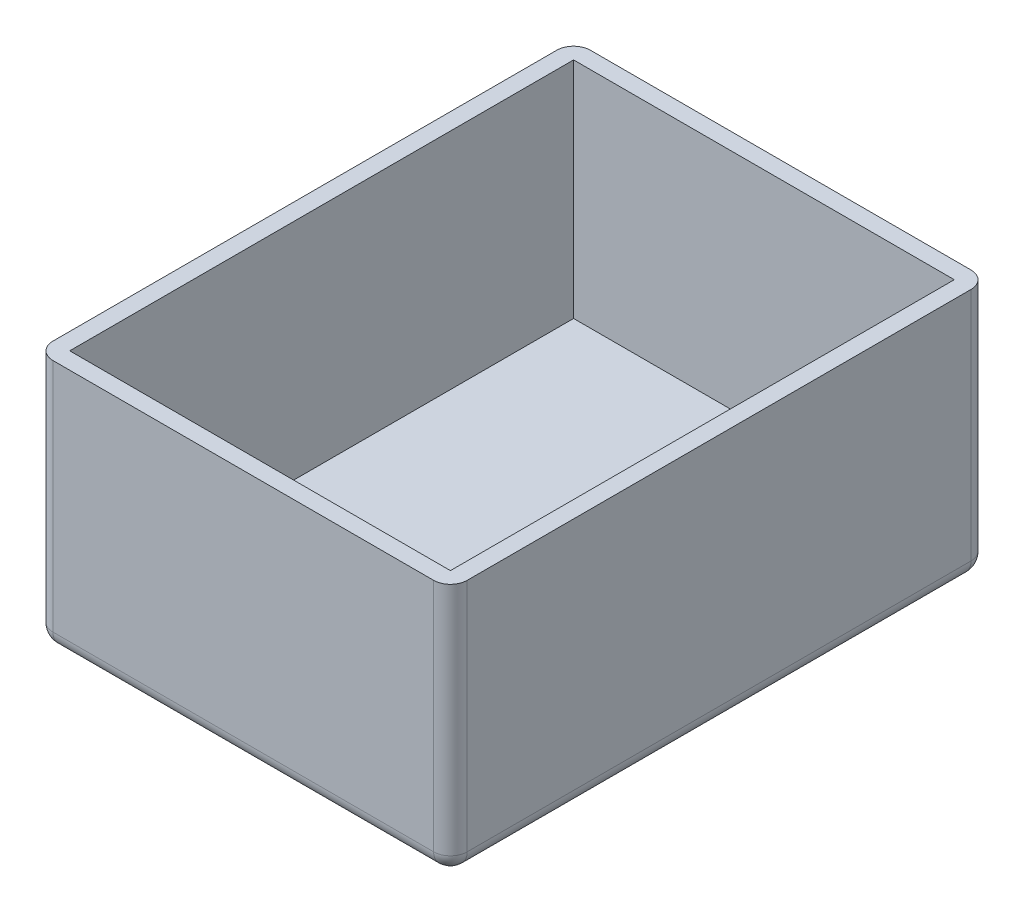
ISO-10303-21;
HEADER;
FILE_DESCRIPTION(('STEP AP214'),'2;1');
FILE_NAME('part.step','',(''),(''),'','','');
FILE_SCHEMA(('AUTOMOTIVE_DESIGN { 1 0 10303 214 1 1 1 1 }'));
ENDSEC;
DATA;
#1=APPLICATION_CONTEXT('core data for automotive mechanical design processes');
#2=APPLICATION_PROTOCOL_DEFINITION('international standard','automotive_design',2000,#1);
#3=PRODUCT_CONTEXT('',#1,'mechanical');
#4=PRODUCT('Part','Part','',(#3));
#5=PRODUCT_RELATED_PRODUCT_CATEGORY('part','',(#4));
#6=PRODUCT_DEFINITION_FORMATION('','',#4);
#7=PRODUCT_DEFINITION_CONTEXT('part definition',#1,'design');
#8=PRODUCT_DEFINITION('design','',#6,#7);
#9=PRODUCT_DEFINITION_SHAPE('','',#8);
#10=(LENGTH_UNIT() NAMED_UNIT(*) SI_UNIT(.MILLI.,.METRE.));
#11=(NAMED_UNIT(*) PLANE_ANGLE_UNIT() SI_UNIT($,.RADIAN.));
#12=(NAMED_UNIT(*) SI_UNIT($,.STERADIAN.) SOLID_ANGLE_UNIT());
#13=UNCERTAINTY_MEASURE_WITH_UNIT(LENGTH_MEASURE(1.E-05),#10,'distance_accuracy_value','');
#14=(GEOMETRIC_REPRESENTATION_CONTEXT(3) GLOBAL_UNCERTAINTY_ASSIGNED_CONTEXT((#13)) GLOBAL_UNIT_ASSIGNED_CONTEXT((#10,
#11,#12)) REPRESENTATION_CONTEXT('',''));
#15=CARTESIAN_POINT('',(0.,0.,0.));
#16=DIRECTION('',(0.,0.,1.));
#17=DIRECTION('',(1.,0.,0.));
#18=AXIS2_PLACEMENT_3D('',#15,#16,#17);
#19=CARTESIAN_POINT('',(0.,45.,0.));
#20=DIRECTION('',(1.,0.,0.));
#21=DIRECTION('',(0.,0.,-1.));
#22=AXIS2_PLACEMENT_3D('',#19,#20,#21);
#23=PLANE('',#22);
#24=DIRECTION('',(0.,0.,1.));
#25=VECTOR('',#24,1.);
#26=CARTESIAN_POINT('',(0.,45.,0.));
#27=LINE('',#26,#25);
#28=CARTESIAN_POINT('',(0.,45.,3.));
#29=VERTEX_POINT('',#28);
#30=CARTESIAN_POINT('',(0.,45.,93.));
#31=VERTEX_POINT('',#30);
#32=EDGE_CURVE('E193',#29,#31,#27,.T.);
#33=ORIENTED_EDGE('',*,*,#32,.F.);
#34=DIRECTION('',(0.,-1.,0.));
#35=VECTOR('',#34,1.);
#36=CARTESIAN_POINT('',(0.,45.,3.));
#37=LINE('',#36,#35);
#38=CARTESIAN_POINT('',(0.,3.,3.));
#39=VERTEX_POINT('',#38);
#40=EDGE_CURVE('E228',#29,#39,#37,.T.);
#41=ORIENTED_EDGE('',*,*,#40,.T.);
#42=DIRECTION('',(0.,0.,1.));
#43=VECTOR('',#42,1.);
#44=CARTESIAN_POINT('',(0.,3.,0.));
#45=LINE('',#44,#43);
#46=CARTESIAN_POINT('',(0.,3.,93.));
#47=VERTEX_POINT('',#46);
#48=EDGE_CURVE('E225',#39,#47,#45,.T.);
#49=ORIENTED_EDGE('',*,*,#48,.T.);
#50=DIRECTION('',(0.,-1.,0.));
#51=VECTOR('',#50,1.);
#52=CARTESIAN_POINT('',(0.,45.,93.));
#53=LINE('',#52,#51);
#54=EDGE_CURVE('E214',#47,#31,#53,.F.);
#55=ORIENTED_EDGE('',*,*,#54,.T.);
#56=EDGE_LOOP('',(#33,#41,#49,#55));
#57=FACE_BOUND('',#56,.T.);
#58=ADVANCED_FACE('F39',(#57),#23,.F.);
#59=CARTESIAN_POINT('',(0.,45.,96.));
#60=DIRECTION('',(0.,0.,-1.));
#61=DIRECTION('',(-1.,0.,0.));
#62=AXIS2_PLACEMENT_3D('',#59,#60,#61);
#63=PLANE('',#62);
#64=DIRECTION('',(1.,0.,0.));
#65=VECTOR('',#64,1.);
#66=CARTESIAN_POINT('',(0.,3.,96.));
#67=LINE('',#66,#65);
#68=CARTESIAN_POINT('',(3.00000000000001,3.,96.));
#69=VERTEX_POINT('',#68);
#70=CARTESIAN_POINT('',(71.,3.,96.));
#71=VERTEX_POINT('',#70);
#72=EDGE_CURVE('E49',#69,#71,#67,.T.);
#73=ORIENTED_EDGE('',*,*,#72,.T.);
#74=DIRECTION('',(0.,-1.,0.));
#75=VECTOR('',#74,1.);
#76=CARTESIAN_POINT('',(71.,45.,96.));
#77=LINE('',#76,#75);
#78=CARTESIAN_POINT('',(71.,45.,96.));
#79=VERTEX_POINT('',#78);
#80=EDGE_CURVE('E11',#71,#79,#77,.F.);
#81=ORIENTED_EDGE('',*,*,#80,.T.);
#82=DIRECTION('',(1.,0.,0.));
#83=VECTOR('',#82,1.);
#84=CARTESIAN_POINT('',(0.,45.,96.));
#85=LINE('',#84,#83);
#86=CARTESIAN_POINT('',(3.00000000000001,45.,96.));
#87=VERTEX_POINT('',#86);
#88=EDGE_CURVE('E202',#87,#79,#85,.T.);
#89=ORIENTED_EDGE('',*,*,#88,.F.);
#90=DIRECTION('',(0.,-1.,0.));
#91=VECTOR('',#90,1.);
#92=CARTESIAN_POINT('',(3.00000000000001,45.,96.));
#93=LINE('',#92,#91);
#94=EDGE_CURVE('E60',#87,#69,#93,.T.);
#95=ORIENTED_EDGE('',*,*,#94,.T.);
#96=EDGE_LOOP('',(#73,#81,#89,#95));
#97=FACE_BOUND('',#96,.T.);
#98=ADVANCED_FACE('F354',(#97),#63,.F.);
#99=CARTESIAN_POINT('',(74.,45.,0.));
#100=DIRECTION('',(-1.,0.,0.));
#101=DIRECTION('',(0.,0.,1.));
#102=AXIS2_PLACEMENT_3D('',#99,#100,#101);
#103=PLANE('',#102);
#104=DIRECTION('',(0.,0.,-1.));
#105=VECTOR('',#104,1.);
#106=CARTESIAN_POINT('',(74.,3.,0.));
#107=LINE('',#106,#105);
#108=CARTESIAN_POINT('',(74.,3.,93.));
#109=VERTEX_POINT('',#108);
#110=CARTESIAN_POINT('',(74.,3.,3.));
#111=VERTEX_POINT('',#110);
#112=EDGE_CURVE('E256',#109,#111,#107,.T.);
#113=ORIENTED_EDGE('',*,*,#112,.T.);
#114=DIRECTION('',(0.,-1.,0.));
#115=VECTOR('',#114,1.);
#116=CARTESIAN_POINT('',(74.,45.,3.));
#117=LINE('',#116,#115);
#118=CARTESIAN_POINT('',(74.,45.,3.));
#119=VERTEX_POINT('',#118);
#120=EDGE_CURVE('E259',#111,#119,#117,.F.);
#121=ORIENTED_EDGE('',*,*,#120,.T.);
#122=DIRECTION('',(0.,0.,-1.));
#123=VECTOR('',#122,1.);
#124=CARTESIAN_POINT('',(74.,45.,0.));
#125=LINE('',#124,#123);
#126=CARTESIAN_POINT('',(74.,45.,93.));
#127=VERTEX_POINT('',#126);
#128=EDGE_CURVE('E206',#127,#119,#125,.T.);
#129=ORIENTED_EDGE('',*,*,#128,.F.);
#130=DIRECTION('',(0.,-1.,0.));
#131=VECTOR('',#130,1.);
#132=CARTESIAN_POINT('',(74.,45.,93.));
#133=LINE('',#132,#131);
#134=EDGE_CURVE('E253',#127,#109,#133,.T.);
#135=ORIENTED_EDGE('',*,*,#134,.T.);
#136=EDGE_LOOP('',(#113,#121,#129,#135));
#137=FACE_BOUND('',#136,.T.);
#138=ADVANCED_FACE('F360',(#137),#103,.F.);
#139=CARTESIAN_POINT('',(0.,45.,0.));
#140=DIRECTION('',(0.,0.,1.));
#141=DIRECTION('',(1.,0.,0.));
#142=AXIS2_PLACEMENT_3D('',#139,#140,#141);
#143=PLANE('',#142);
#144=DIRECTION('',(-1.,0.,0.));
#145=VECTOR('',#144,1.);
#146=CARTESIAN_POINT('',(0.,3.,0.));
#147=LINE('',#146,#145);
#148=CARTESIAN_POINT('',(71.,3.,0.));
#149=VERTEX_POINT('',#148);
#150=CARTESIAN_POINT('',(3.,3.,0.));
#151=VERTEX_POINT('',#150);
#152=EDGE_CURVE('E232',#149,#151,#147,.T.);
#153=ORIENTED_EDGE('',*,*,#152,.T.);
#154=DIRECTION('',(0.,-1.,0.));
#155=VECTOR('',#154,1.);
#156=CARTESIAN_POINT('',(3.,45.,0.));
#157=LINE('',#156,#155);
#158=CARTESIAN_POINT('',(3.,45.,0.));
#159=VERTEX_POINT('',#158);
#160=EDGE_CURVE('E238',#151,#159,#157,.F.);
#161=ORIENTED_EDGE('',*,*,#160,.T.);
#162=DIRECTION('',(-1.,0.,0.));
#163=VECTOR('',#162,1.);
#164=CARTESIAN_POINT('',(0.,45.,0.));
#165=LINE('',#164,#163);
#166=CARTESIAN_POINT('',(71.,45.,0.));
#167=VERTEX_POINT('',#166);
#168=EDGE_CURVE('E210',#167,#159,#165,.T.);
#169=ORIENTED_EDGE('',*,*,#168,.F.);
#170=DIRECTION('',(0.,-1.,0.));
#171=VECTOR('',#170,1.);
#172=CARTESIAN_POINT('',(71.,45.,0.));
#173=LINE('',#172,#171);
#174=EDGE_CURVE('E235',#167,#149,#173,.T.);
#175=ORIENTED_EDGE('',*,*,#174,.T.);
#176=EDGE_LOOP('',(#153,#161,#169,#175));
#177=FACE_BOUND('',#176,.T.);
#178=ADVANCED_FACE('F349',(#177),#143,.F.);
#179=CARTESIAN_POINT('',(0.,45.,0.));
#180=DIRECTION('',(0.,1.,0.));
#181=DIRECTION('',(0.,0.,1.));
#182=AXIS2_PLACEMENT_3D('',#179,#180,#181);
#183=PLANE('',#182);
#184=DIRECTION('',(-1.,0.,0.));
#185=VECTOR('',#184,1.);
#186=CARTESIAN_POINT('',(71.,45.,3.));
#187=LINE('',#186,#185);
#188=CARTESIAN_POINT('',(71.,45.,3.));
#189=VERTEX_POINT('',#188);
#190=CARTESIAN_POINT('',(3.,45.,3.));
#191=VERTEX_POINT('',#190);
#192=EDGE_CURVE('E147',#189,#191,#187,.T.);
#193=ORIENTED_EDGE('',*,*,#192,.F.);
#194=DIRECTION('',(0.,0.,-1.));
#195=VECTOR('',#194,1.);
#196=CARTESIAN_POINT('',(71.,45.,93.));
#197=LINE('',#196,#195);
#198=CARTESIAN_POINT('',(71.,45.,93.));
#199=VERTEX_POINT('',#198);
#200=EDGE_CURVE('E167',#199,#189,#197,.T.);
#201=ORIENTED_EDGE('',*,*,#200,.F.);
#202=DIRECTION('',(1.,0.,0.));
#203=VECTOR('',#202,1.);
#204=CARTESIAN_POINT('',(3.00000000000001,45.,93.));
#205=LINE('',#204,#203);
#206=CARTESIAN_POINT('',(3.00000000000001,45.,93.));
#207=VERTEX_POINT('',#206);
#208=EDGE_CURVE('E171',#207,#199,#205,.T.);
#209=ORIENTED_EDGE('',*,*,#208,.F.);
#210=DIRECTION('',(0.,0.,1.));
#211=VECTOR('',#210,1.);
#212=CARTESIAN_POINT('',(3.,45.,3.));
#213=LINE('',#212,#211);
#214=EDGE_CURVE('E183',#191,#207,#213,.T.);
#215=ORIENTED_EDGE('',*,*,#214,.F.);
#216=EDGE_LOOP('',(#193,#201,#209,#215));
#217=FACE_BOUND('',#216,.T.);
#218=ORIENTED_EDGE('',*,*,#168,.T.);
#219=CARTESIAN_POINT('',(3.,45.,3.));
#220=DIRECTION('',(0.,1.,0.));
#221=DIRECTION('',(0.,0.,1.));
#222=AXIS2_PLACEMENT_3D('',#219,#220,#221);
#223=CIRCLE('',#222,3.);
#224=EDGE_CURVE('E250',#159,#29,#223,.T.);
#225=ORIENTED_EDGE('',*,*,#224,.T.);
#226=ORIENTED_EDGE('',*,*,#32,.T.);
#227=CARTESIAN_POINT('',(3.00000000000001,45.,93.));
#228=DIRECTION('',(0.,1.,0.));
#229=DIRECTION('',(0.,0.,1.));
#230=AXIS2_PLACEMENT_3D('',#227,#228,#229);
#231=CIRCLE('',#230,3.);
#232=EDGE_CURVE('E241',#31,#87,#231,.T.);
#233=ORIENTED_EDGE('',*,*,#232,.T.);
#234=ORIENTED_EDGE('',*,*,#88,.T.);
#235=CARTESIAN_POINT('',(71.,45.,93.));
#236=DIRECTION('',(0.,1.,0.));
#237=DIRECTION('',(0.,0.,1.));
#238=AXIS2_PLACEMENT_3D('',#235,#236,#237);
#239=CIRCLE('',#238,3.);
#240=EDGE_CURVE('E244',#79,#127,#239,.T.);
#241=ORIENTED_EDGE('',*,*,#240,.T.);
#242=ORIENTED_EDGE('',*,*,#128,.T.);
#243=CARTESIAN_POINT('',(71.,45.,3.));
#244=DIRECTION('',(0.,1.,0.));
#245=DIRECTION('',(0.,0.,1.));
#246=AXIS2_PLACEMENT_3D('',#243,#244,#245);
#247=CIRCLE('',#246,3.);
#248=EDGE_CURVE('E247',#119,#167,#247,.T.);
#249=ORIENTED_EDGE('',*,*,#248,.T.);
#250=EDGE_LOOP('',(#218,#225,#226,#233,#234,#241,#242,#249));
#251=FACE_BOUND('',#250,.T.);
#252=ADVANCED_FACE('F340',(#217,#251),#183,.T.);
#253=CARTESIAN_POINT('',(0.,0.,0.));
#254=DIRECTION('',(0.,1.,0.));
#255=DIRECTION('',(0.,0.,1.));
#256=AXIS2_PLACEMENT_3D('',#253,#254,#255);
#257=PLANE('',#256);
#258=DIRECTION('',(0.,0.,1.));
#259=VECTOR('',#258,1.);
#260=CARTESIAN_POINT('',(3.,0.,0.));
#261=LINE('',#260,#259);
#262=CARTESIAN_POINT('',(3.00000000000001,0.,93.));
#263=VERTEX_POINT('',#262);
#264=CARTESIAN_POINT('',(3.,0.,3.));
#265=VERTEX_POINT('',#264);
#266=EDGE_CURVE('E268',#263,#265,#261,.F.);
#267=ORIENTED_EDGE('',*,*,#266,.T.);
#268=DIRECTION('',(-1.,0.,0.));
#269=VECTOR('',#268,1.);
#270=CARTESIAN_POINT('',(0.,0.,3.));
#271=LINE('',#270,#269);
#272=CARTESIAN_POINT('',(71.,0.,3.));
#273=VERTEX_POINT('',#272);
#274=EDGE_CURVE('E271',#265,#273,#271,.F.);
#275=ORIENTED_EDGE('',*,*,#274,.T.);
#276=DIRECTION('',(0.,0.,-1.));
#277=VECTOR('',#276,1.);
#278=CARTESIAN_POINT('',(71.,0.,0.));
#279=LINE('',#278,#277);
#280=CARTESIAN_POINT('',(71.,0.,93.));
#281=VERTEX_POINT('',#280);
#282=EDGE_CURVE('E265',#273,#281,#279,.F.);
#283=ORIENTED_EDGE('',*,*,#282,.T.);
#284=DIRECTION('',(1.,0.,0.));
#285=VECTOR('',#284,1.);
#286=CARTESIAN_POINT('',(0.,0.,93.));
#287=LINE('',#286,#285);
#288=EDGE_CURVE('E262',#281,#263,#287,.F.);
#289=ORIENTED_EDGE('',*,*,#288,.T.);
#290=EDGE_LOOP('',(#267,#275,#283,#289));
#291=FACE_BOUND('',#290,.T.);
#292=CARTESIAN_POINT('',(24.,0.,81.8));
#293=DIRECTION('',(0.,-1.,0.));
#294=DIRECTION('',(0.,0.,-1.));
#295=AXIS2_PLACEMENT_3D('',#292,#293,#294);
#296=CIRCLE('',#295,3.);
#297=CARTESIAN_POINT('',(24.,0.,78.8));
#298=VERTEX_POINT('',#297);
#299=EDGE_CURVE('E219',#298,#298,#296,.T.);
#300=ORIENTED_EDGE('',*,*,#299,.F.);
#301=EDGE_LOOP('',(#300));
#302=FACE_BOUND('',#301,.T.);
#303=CARTESIAN_POINT('',(37.,0.,60.));
#304=DIRECTION('',(0.,-1.,0.));
#305=DIRECTION('',(0.,0.,-1.));
#306=AXIS2_PLACEMENT_3D('',#303,#304,#305);
#307=CIRCLE('',#306,5.);
#308=CARTESIAN_POINT('',(37.,0.,55.));
#309=VERTEX_POINT('',#308);
#310=EDGE_CURVE('E174',#309,#309,#307,.T.);
#311=ORIENTED_EDGE('',*,*,#310,.F.);
#312=EDGE_LOOP('',(#311));
#313=FACE_BOUND('',#312,.T.);
#314=ADVANCED_FACE('F337',(#291,#302,#313),#257,.F.);
#315=CARTESIAN_POINT('',(71.,5.,3.));
#316=DIRECTION('',(0.,0.,-1.));
#317=DIRECTION('',(-1.,0.,0.));
#318=AXIS2_PLACEMENT_3D('',#315,#316,#317);
#319=PLANE('',#318);
#320=ORIENTED_EDGE('',*,*,#192,.T.);
#321=DIRECTION('',(0.,1.,0.));
#322=VECTOR('',#321,1.);
#323=CARTESIAN_POINT('',(3.,5.,3.));
#324=LINE('',#323,#322);
#325=CARTESIAN_POINT('',(3.,5.,3.));
#326=VERTEX_POINT('',#325);
#327=EDGE_CURVE('E140',#326,#191,#324,.T.);
#328=ORIENTED_EDGE('',*,*,#327,.F.);
#329=DIRECTION('',(-1.,0.,0.));
#330=VECTOR('',#329,1.);
#331=CARTESIAN_POINT('',(71.,5.,3.));
#332=LINE('',#331,#330);
#333=CARTESIAN_POINT('',(71.,5.,3.));
#334=VERTEX_POINT('',#333);
#335=EDGE_CURVE('E144',#334,#326,#332,.T.);
#336=ORIENTED_EDGE('',*,*,#335,.F.);
#337=DIRECTION('',(0.,1.,0.));
#338=VECTOR('',#337,1.);
#339=CARTESIAN_POINT('',(71.,5.,3.));
#340=LINE('',#339,#338);
#341=EDGE_CURVE('E190',#334,#189,#340,.T.);
#342=ORIENTED_EDGE('',*,*,#341,.T.);
#343=EDGE_LOOP('',(#320,#328,#336,#342));
#344=FACE_BOUND('',#343,.T.);
#345=ADVANCED_FACE('F142',(#344),#319,.F.);
#346=CARTESIAN_POINT('',(71.,5.,93.));
#347=DIRECTION('',(1.,0.,0.));
#348=DIRECTION('',(0.,0.,-1.));
#349=AXIS2_PLACEMENT_3D('',#346,#347,#348);
#350=PLANE('',#349);
#351=ORIENTED_EDGE('',*,*,#200,.T.);
#352=ORIENTED_EDGE('',*,*,#341,.F.);
#353=DIRECTION('',(0.,0.,-1.));
#354=VECTOR('',#353,1.);
#355=CARTESIAN_POINT('',(71.,5.,93.));
#356=LINE('',#355,#354);
#357=CARTESIAN_POINT('',(71.,5.,93.));
#358=VERTEX_POINT('',#357);
#359=EDGE_CURVE('E153',#358,#334,#356,.T.);
#360=ORIENTED_EDGE('',*,*,#359,.F.);
#361=DIRECTION('',(0.,1.,0.));
#362=VECTOR('',#361,1.);
#363=CARTESIAN_POINT('',(71.,5.,93.));
#364=LINE('',#363,#362);
#365=EDGE_CURVE('E194',#358,#199,#364,.T.);
#366=ORIENTED_EDGE('',*,*,#365,.T.);
#367=EDGE_LOOP('',(#351,#352,#360,#366));
#368=FACE_BOUND('',#367,.T.);
#369=ADVANCED_FACE('F347',(#368),#350,.F.);
#370=CARTESIAN_POINT('',(3.00000000000001,5.,93.));
#371=DIRECTION('',(0.,0.,1.));
#372=DIRECTION('',(1.,0.,0.));
#373=AXIS2_PLACEMENT_3D('',#370,#371,#372);
#374=PLANE('',#373);
#375=ORIENTED_EDGE('',*,*,#208,.T.);
#376=ORIENTED_EDGE('',*,*,#365,.F.);
#377=DIRECTION('',(1.,0.,0.));
#378=VECTOR('',#377,1.);
#379=CARTESIAN_POINT('',(3.00000000000001,5.,93.));
#380=LINE('',#379,#378);
#381=CARTESIAN_POINT('',(3.00000000000001,5.,93.));
#382=VERTEX_POINT('',#381);
#383=EDGE_CURVE('E162',#382,#358,#380,.T.);
#384=ORIENTED_EDGE('',*,*,#383,.F.);
#385=DIRECTION('',(0.,1.,0.));
#386=VECTOR('',#385,1.);
#387=CARTESIAN_POINT('',(3.00000000000001,5.,93.));
#388=LINE('',#387,#386);
#389=EDGE_CURVE('E152',#382,#207,#388,.T.);
#390=ORIENTED_EDGE('',*,*,#389,.T.);
#391=EDGE_LOOP('',(#375,#376,#384,#390));
#392=FACE_BOUND('',#391,.T.);
#393=ADVANCED_FACE('F491',(#392),#374,.F.);
#394=CARTESIAN_POINT('',(3.,5.,3.));
#395=DIRECTION('',(-1.,0.,0.));
#396=DIRECTION('',(0.,0.,1.));
#397=AXIS2_PLACEMENT_3D('',#394,#395,#396);
#398=PLANE('',#397);
#399=ORIENTED_EDGE('',*,*,#214,.T.);
#400=ORIENTED_EDGE('',*,*,#389,.F.);
#401=DIRECTION('',(0.,0.,1.));
#402=VECTOR('',#401,1.);
#403=CARTESIAN_POINT('',(3.,5.,3.));
#404=LINE('',#403,#402);
#405=EDGE_CURVE('E156',#326,#382,#404,.T.);
#406=ORIENTED_EDGE('',*,*,#405,.F.);
#407=ORIENTED_EDGE('',*,*,#327,.T.);
#408=EDGE_LOOP('',(#399,#400,#406,#407));
#409=FACE_BOUND('',#408,.T.);
#410=ADVANCED_FACE('F157',(#409),#398,.F.);
#411=CARTESIAN_POINT('',(0.,5.,0.));
#412=DIRECTION('',(0.,1.,0.));
#413=DIRECTION('',(0.,0.,1.));
#414=AXIS2_PLACEMENT_3D('',#411,#412,#413);
#415=PLANE('',#414);
#416=CARTESIAN_POINT('',(24.,5.,81.8));
#417=DIRECTION('',(0.,1.,0.));
#418=DIRECTION('',(0.,0.,1.));
#419=AXIS2_PLACEMENT_3D('',#416,#417,#418);
#420=CIRCLE('',#419,3.);
#421=CARTESIAN_POINT('',(24.,5.,84.8));
#422=VERTEX_POINT('',#421);
#423=EDGE_CURVE('E184',#422,#422,#420,.T.);
#424=ORIENTED_EDGE('',*,*,#423,.F.);
#425=EDGE_LOOP('',(#424));
#426=FACE_BOUND('',#425,.T.);
#427=CARTESIAN_POINT('',(37.,5.,60.));
#428=DIRECTION('',(0.,1.,0.));
#429=DIRECTION('',(0.,0.,1.));
#430=AXIS2_PLACEMENT_3D('',#427,#428,#429);
#431=CIRCLE('',#430,5.);
#432=CARTESIAN_POINT('',(37.,5.,65.));
#433=VERTEX_POINT('',#432);
#434=EDGE_CURVE('E215',#433,#433,#431,.T.);
#435=ORIENTED_EDGE('',*,*,#434,.F.);
#436=EDGE_LOOP('',(#435));
#437=FACE_BOUND('',#436,.T.);
#438=ORIENTED_EDGE('',*,*,#335,.T.);
#439=ORIENTED_EDGE('',*,*,#405,.T.);
#440=ORIENTED_EDGE('',*,*,#383,.T.);
#441=ORIENTED_EDGE('',*,*,#359,.T.);
#442=EDGE_LOOP('',(#438,#439,#440,#441));
#443=FACE_BOUND('',#442,.T.);
#444=ADVANCED_FACE('F164',(#426,#437,#443),#415,.T.);
#445=CARTESIAN_POINT('',(37.,40.,60.));
#446=DIRECTION('',(0.,-1.,0.));
#447=DIRECTION('',(0.,0.,-1.));
#448=AXIS2_PLACEMENT_3D('',#445,#446,#447);
#449=CYLINDRICAL_SURFACE('',#448,5.);
#450=ORIENTED_EDGE('',*,*,#434,.T.);
#451=EDGE_LOOP('',(#450));
#452=FACE_BOUND('',#451,.T.);
#453=ORIENTED_EDGE('',*,*,#310,.T.);
#454=EDGE_LOOP('',(#453));
#455=FACE_BOUND('',#454,.T.);
#456=ADVANCED_FACE('F462',(#452,#455),#449,.F.);
#457=CARTESIAN_POINT('',(24.,40.,81.8));
#458=DIRECTION('',(0.,-1.,0.));
#459=DIRECTION('',(0.,0.,-1.));
#460=AXIS2_PLACEMENT_3D('',#457,#458,#459);
#461=CYLINDRICAL_SURFACE('',#460,3.);
#462=ORIENTED_EDGE('',*,*,#423,.T.);
#463=EDGE_LOOP('',(#462));
#464=FACE_BOUND('',#463,.T.);
#465=ORIENTED_EDGE('',*,*,#299,.T.);
#466=EDGE_LOOP('',(#465));
#467=FACE_BOUND('',#466,.T.);
#468=ADVANCED_FACE('F335',(#464,#467),#461,.F.);
#469=CARTESIAN_POINT('',(71.,45.,93.));
#470=DIRECTION('',(0.,-1.,0.));
#471=DIRECTION('',(0.,0.,-1.));
#472=AXIS2_PLACEMENT_3D('',#469,#470,#471);
#473=CYLINDRICAL_SURFACE('',#472,3.);
#474=CARTESIAN_POINT('',(71.,3.,93.));
#475=DIRECTION('',(0.,-1.,0.));
#476=DIRECTION('',(0.,0.,-1.));
#477=AXIS2_PLACEMENT_3D('',#474,#475,#476);
#478=CIRCLE('',#477,3.);
#479=EDGE_CURVE('E43',#109,#71,#478,.T.);
#480=ORIENTED_EDGE('',*,*,#479,.F.);
#481=ORIENTED_EDGE('',*,*,#134,.F.);
#482=ORIENTED_EDGE('',*,*,#240,.F.);
#483=ORIENTED_EDGE('',*,*,#80,.F.);
#484=EDGE_LOOP('',(#480,#481,#482,#483));
#485=FACE_BOUND('',#484,.T.);
#486=ADVANCED_FACE('F41',(#485),#473,.T.);
#487=CARTESIAN_POINT('',(71.,3.,93.));
#488=DIRECTION('',(0.,0.,1.));
#489=DIRECTION('',(1.,0.,0.));
#490=AXIS2_PLACEMENT_3D('',#487,#488,#489);
#491=SPHERICAL_SURFACE('',#490,3.);
#492=CARTESIAN_POINT('',(71.,3.,93.));
#493=DIRECTION('',(0.,0.,1.));
#494=DIRECTION('',(1.,0.,0.));
#495=AXIS2_PLACEMENT_3D('',#492,#493,#494);
#496=CIRCLE('',#495,3.);
#497=EDGE_CURVE('E313',#109,#281,#496,.F.);
#498=ORIENTED_EDGE('',*,*,#497,.F.);
#499=ORIENTED_EDGE('',*,*,#479,.T.);
#500=CARTESIAN_POINT('',(71.,3.,93.));
#501=DIRECTION('',(1.,0.,0.));
#502=DIRECTION('',(0.,0.,-1.));
#503=AXIS2_PLACEMENT_3D('',#500,#501,#502);
#504=CIRCLE('',#503,3.);
#505=EDGE_CURVE('E316',#281,#71,#504,.F.);
#506=ORIENTED_EDGE('',*,*,#505,.F.);
#507=EDGE_LOOP('',(#498,#499,#506));
#508=FACE_BOUND('',#507,.T.);
#509=ADVANCED_FACE('F402',(#508),#491,.T.);
#510=CARTESIAN_POINT('',(3.00000000000001,45.,93.));
#511=DIRECTION('',(0.,-1.,0.));
#512=DIRECTION('',(0.,0.,-1.));
#513=AXIS2_PLACEMENT_3D('',#510,#511,#512);
#514=CYLINDRICAL_SURFACE('',#513,3.);
#515=ORIENTED_EDGE('',*,*,#232,.F.);
#516=ORIENTED_EDGE('',*,*,#54,.F.);
#517=CARTESIAN_POINT('',(3.00000000000001,3.,93.));
#518=DIRECTION('',(0.,-1.,0.));
#519=DIRECTION('',(0.,0.,-1.));
#520=AXIS2_PLACEMENT_3D('',#517,#518,#519);
#521=CIRCLE('',#520,3.);
#522=EDGE_CURVE('E309',#69,#47,#521,.T.);
#523=ORIENTED_EDGE('',*,*,#522,.F.);
#524=ORIENTED_EDGE('',*,*,#94,.F.);
#525=EDGE_LOOP('',(#515,#516,#523,#524));
#526=FACE_BOUND('',#525,.T.);
#527=ADVANCED_FACE('F400',(#526),#514,.T.);
#528=CARTESIAN_POINT('',(0.,3.,93.));
#529=DIRECTION('',(1.,0.,0.));
#530=DIRECTION('',(0.,0.,-1.));
#531=AXIS2_PLACEMENT_3D('',#528,#529,#530);
#532=CYLINDRICAL_SURFACE('',#531,3.);
#533=ORIENTED_EDGE('',*,*,#505,.T.);
#534=ORIENTED_EDGE('',*,*,#72,.F.);
#535=CARTESIAN_POINT('',(3.00000000000001,3.,93.));
#536=DIRECTION('',(-1.,0.,0.));
#537=DIRECTION('',(0.,0.,1.));
#538=AXIS2_PLACEMENT_3D('',#535,#536,#537);
#539=CIRCLE('',#538,3.);
#540=EDGE_CURVE('E305',#263,#69,#539,.T.);
#541=ORIENTED_EDGE('',*,*,#540,.F.);
#542=ORIENTED_EDGE('',*,*,#288,.F.);
#543=EDGE_LOOP('',(#533,#534,#541,#542));
#544=FACE_BOUND('',#543,.T.);
#545=ADVANCED_FACE('F396',(#544),#532,.T.);
#546=CARTESIAN_POINT('',(71.,3.,0.));
#547=DIRECTION('',(0.,0.,-1.));
#548=DIRECTION('',(-1.,0.,0.));
#549=AXIS2_PLACEMENT_3D('',#546,#547,#548);
#550=CYLINDRICAL_SURFACE('',#549,3.);
#551=ORIENTED_EDGE('',*,*,#497,.T.);
#552=ORIENTED_EDGE('',*,*,#282,.F.);
#553=CARTESIAN_POINT('',(71.,3.,3.));
#554=DIRECTION('',(0.,0.,-1.));
#555=DIRECTION('',(-1.,0.,0.));
#556=AXIS2_PLACEMENT_3D('',#553,#554,#555);
#557=CIRCLE('',#556,3.);
#558=EDGE_CURVE('E301',#111,#273,#557,.T.);
#559=ORIENTED_EDGE('',*,*,#558,.F.);
#560=ORIENTED_EDGE('',*,*,#112,.F.);
#561=EDGE_LOOP('',(#551,#552,#559,#560));
#562=FACE_BOUND('',#561,.T.);
#563=ADVANCED_FACE('F392',(#562),#550,.T.);
#564=CARTESIAN_POINT('',(71.,45.,3.));
#565=DIRECTION('',(0.,-1.,0.));
#566=DIRECTION('',(0.,0.,-1.));
#567=AXIS2_PLACEMENT_3D('',#564,#565,#566);
#568=CYLINDRICAL_SURFACE('',#567,3.);
#569=ORIENTED_EDGE('',*,*,#248,.F.);
#570=ORIENTED_EDGE('',*,*,#120,.F.);
#571=CARTESIAN_POINT('',(71.,3.,3.));
#572=DIRECTION('',(0.,-1.,0.));
#573=DIRECTION('',(0.,0.,-1.));
#574=AXIS2_PLACEMENT_3D('',#571,#572,#573);
#575=CIRCLE('',#574,3.);
#576=EDGE_CURVE('E297',#149,#111,#575,.T.);
#577=ORIENTED_EDGE('',*,*,#576,.F.);
#578=ORIENTED_EDGE('',*,*,#174,.F.);
#579=EDGE_LOOP('',(#569,#570,#577,#578));
#580=FACE_BOUND('',#579,.T.);
#581=ADVANCED_FACE('F388',(#580),#568,.T.);
#582=CARTESIAN_POINT('',(3.00000000000001,3.,93.));
#583=DIRECTION('',(0.,0.,1.));
#584=DIRECTION('',(1.,0.,0.));
#585=AXIS2_PLACEMENT_3D('',#582,#583,#584);
#586=SPHERICAL_SURFACE('',#585,3.);
#587=ORIENTED_EDGE('',*,*,#540,.T.);
#588=ORIENTED_EDGE('',*,*,#522,.T.);
#589=CARTESIAN_POINT('',(3.00000000000001,3.,93.));
#590=DIRECTION('',(0.,0.,1.));
#591=DIRECTION('',(1.,0.,0.));
#592=AXIS2_PLACEMENT_3D('',#589,#590,#591);
#593=CIRCLE('',#592,3.);
#594=EDGE_CURVE('E293',#263,#47,#593,.F.);
#595=ORIENTED_EDGE('',*,*,#594,.F.);
#596=EDGE_LOOP('',(#587,#588,#595));
#597=FACE_BOUND('',#596,.T.);
#598=ADVANCED_FACE('F384',(#597),#586,.T.);
#599=CARTESIAN_POINT('',(71.,3.,3.));
#600=DIRECTION('',(0.,0.,1.));
#601=DIRECTION('',(1.,0.,0.));
#602=AXIS2_PLACEMENT_3D('',#599,#600,#601);
#603=SPHERICAL_SURFACE('',#602,3.);
#604=ORIENTED_EDGE('',*,*,#576,.T.);
#605=ORIENTED_EDGE('',*,*,#558,.T.);
#606=CARTESIAN_POINT('',(71.,3.,3.));
#607=DIRECTION('',(1.,0.,0.));
#608=DIRECTION('',(0.,0.,-1.));
#609=AXIS2_PLACEMENT_3D('',#606,#607,#608);
#610=CIRCLE('',#609,3.);
#611=EDGE_CURVE('E290',#149,#273,#610,.F.);
#612=ORIENTED_EDGE('',*,*,#611,.F.);
#613=EDGE_LOOP('',(#604,#605,#612));
#614=FACE_BOUND('',#613,.T.);
#615=ADVANCED_FACE('F380',(#614),#603,.T.);
#616=CARTESIAN_POINT('',(3.,3.,0.));
#617=DIRECTION('',(0.,0.,1.));
#618=DIRECTION('',(1.,0.,0.));
#619=AXIS2_PLACEMENT_3D('',#616,#617,#618);
#620=CYLINDRICAL_SURFACE('',#619,3.);
#621=ORIENTED_EDGE('',*,*,#594,.T.);
#622=ORIENTED_EDGE('',*,*,#48,.F.);
#623=CARTESIAN_POINT('',(3.,3.,3.));
#624=DIRECTION('',(0.,0.,-1.));
#625=DIRECTION('',(-1.,0.,0.));
#626=AXIS2_PLACEMENT_3D('',#623,#624,#625);
#627=CIRCLE('',#626,3.);
#628=EDGE_CURVE('E286',#265,#39,#627,.T.);
#629=ORIENTED_EDGE('',*,*,#628,.F.);
#630=ORIENTED_EDGE('',*,*,#266,.F.);
#631=EDGE_LOOP('',(#621,#622,#629,#630));
#632=FACE_BOUND('',#631,.T.);
#633=ADVANCED_FACE('F376',(#632),#620,.T.);
#634=CARTESIAN_POINT('',(0.,3.,3.));
#635=DIRECTION('',(-1.,0.,0.));
#636=DIRECTION('',(0.,0.,1.));
#637=AXIS2_PLACEMENT_3D('',#634,#635,#636);
#638=CYLINDRICAL_SURFACE('',#637,3.);
#639=ORIENTED_EDGE('',*,*,#611,.T.);
#640=ORIENTED_EDGE('',*,*,#274,.F.);
#641=CARTESIAN_POINT('',(3.,3.,3.));
#642=DIRECTION('',(-1.,0.,0.));
#643=DIRECTION('',(0.,0.,1.));
#644=AXIS2_PLACEMENT_3D('',#641,#642,#643);
#645=CIRCLE('',#644,3.);
#646=EDGE_CURVE('E282',#151,#265,#645,.T.);
#647=ORIENTED_EDGE('',*,*,#646,.F.);
#648=ORIENTED_EDGE('',*,*,#152,.F.);
#649=EDGE_LOOP('',(#639,#640,#647,#648));
#650=FACE_BOUND('',#649,.T.);
#651=ADVANCED_FACE('F372',(#650),#638,.T.);
#652=CARTESIAN_POINT('',(3.,3.,3.));
#653=DIRECTION('',(0.,0.,1.));
#654=DIRECTION('',(1.,0.,0.));
#655=AXIS2_PLACEMENT_3D('',#652,#653,#654);
#656=SPHERICAL_SURFACE('',#655,3.);
#657=ORIENTED_EDGE('',*,*,#646,.T.);
#658=ORIENTED_EDGE('',*,*,#628,.T.);
#659=CARTESIAN_POINT('',(3.,3.,3.));
#660=DIRECTION('',(0.,-1.,0.));
#661=DIRECTION('',(0.,0.,-1.));
#662=AXIS2_PLACEMENT_3D('',#659,#660,#661);
#663=CIRCLE('',#662,3.);
#664=EDGE_CURVE('E279',#151,#39,#663,.F.);
#665=ORIENTED_EDGE('',*,*,#664,.F.);
#666=EDGE_LOOP('',(#657,#658,#665));
#667=FACE_BOUND('',#666,.T.);
#668=ADVANCED_FACE('F368',(#667),#656,.T.);
#669=CARTESIAN_POINT('',(3.,45.,3.));
#670=DIRECTION('',(0.,-1.,0.));
#671=DIRECTION('',(0.,0.,-1.));
#672=AXIS2_PLACEMENT_3D('',#669,#670,#671);
#673=CYLINDRICAL_SURFACE('',#672,3.);
#674=ORIENTED_EDGE('',*,*,#224,.F.);
#675=ORIENTED_EDGE('',*,*,#160,.F.);
#676=ORIENTED_EDGE('',*,*,#664,.T.);
#677=ORIENTED_EDGE('',*,*,#40,.F.);
#678=EDGE_LOOP('',(#674,#675,#676,#677));
#679=FACE_BOUND('',#678,.T.);
#680=ADVANCED_FACE('F365',(#679),#673,.T.);
#681=CLOSED_SHELL('',(#58,#98,#138,#178,#252,#314,#345,#369,#393,#410,#444,#456,#468,#486,#509,
#527,#545,#563,#581,#598,#615,#633,#651,#668,#680));
#682=MANIFOLD_SOLID_BREP('B2',#681);
#683=ADVANCED_BREP_SHAPE_REPRESENTATION('',(#18,#682),#14);
#684=SHAPE_DEFINITION_REPRESENTATION(#9,#683);
ENDSEC;
END-ISO-10303-21;
